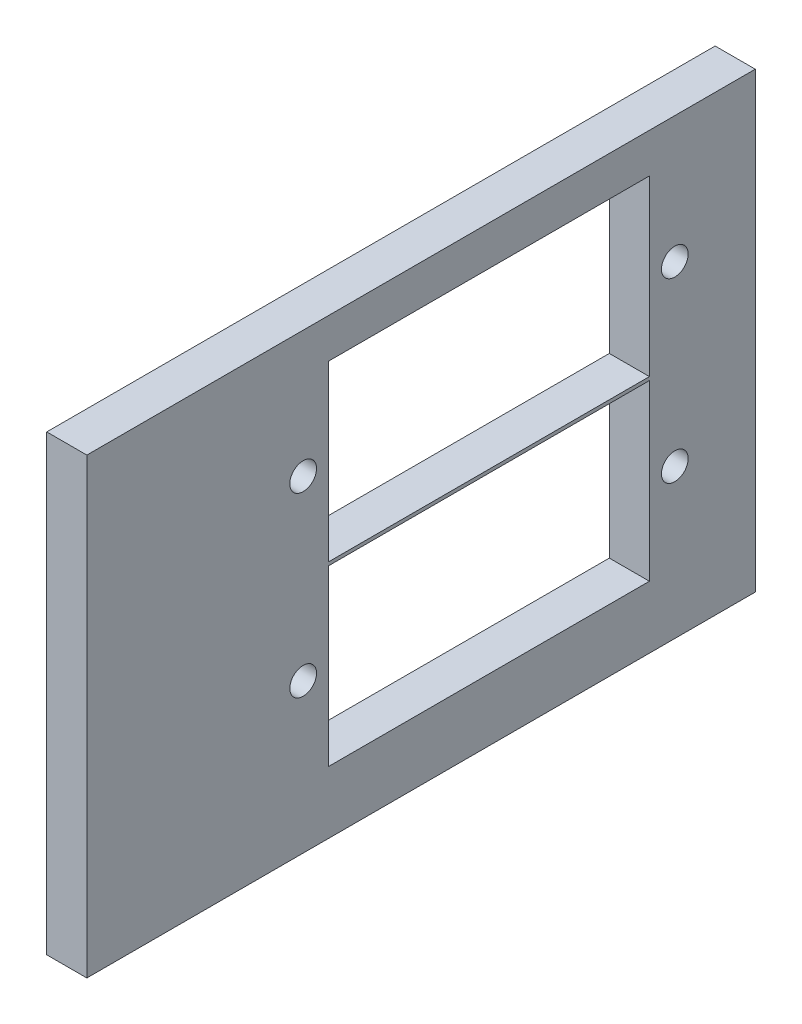
ISO-10303-21;
HEADER;
FILE_DESCRIPTION(('STEP AP214'),'2;1');
FILE_NAME('part.step','',(''),(''),'','','');
FILE_SCHEMA(('AUTOMOTIVE_DESIGN { 1 0 10303 214 1 1 1 1 }'));
ENDSEC;
DATA;
#1=APPLICATION_CONTEXT('core data for automotive mechanical design processes');
#2=APPLICATION_PROTOCOL_DEFINITION('international standard','automotive_design',2000,#1);
#3=PRODUCT_CONTEXT('',#1,'mechanical');
#4=PRODUCT('Part','Part','',(#3));
#5=PRODUCT_RELATED_PRODUCT_CATEGORY('part','',(#4));
#6=PRODUCT_DEFINITION_FORMATION('','',#4);
#7=PRODUCT_DEFINITION_CONTEXT('part definition',#1,'design');
#8=PRODUCT_DEFINITION('design','',#6,#7);
#9=PRODUCT_DEFINITION_SHAPE('','',#8);
#10=(LENGTH_UNIT() NAMED_UNIT(*) SI_UNIT(.MILLI.,.METRE.));
#11=(NAMED_UNIT(*) PLANE_ANGLE_UNIT() SI_UNIT($,.RADIAN.));
#12=(NAMED_UNIT(*) SI_UNIT($,.STERADIAN.) SOLID_ANGLE_UNIT());
#13=UNCERTAINTY_MEASURE_WITH_UNIT(LENGTH_MEASURE(1.E-05),#10,'distance_accuracy_value','');
#14=(GEOMETRIC_REPRESENTATION_CONTEXT(3) GLOBAL_UNCERTAINTY_ASSIGNED_CONTEXT((#13)) GLOBAL_UNIT_ASSIGNED_CONTEXT((#10,
#11,#12)) REPRESENTATION_CONTEXT('',''));
#15=CARTESIAN_POINT('',(0.,0.,0.));
#16=DIRECTION('',(0.,0.,1.));
#17=DIRECTION('',(1.,0.,0.));
#18=AXIS2_PLACEMENT_3D('',#15,#16,#17);
#19=CARTESIAN_POINT('',(3.,-56.7136635749748,-41.0383830188961));
#20=DIRECTION('',(0.,0.,1.));
#21=DIRECTION('',(1.,0.,0.));
#22=AXIS2_PLACEMENT_3D('',#19,#20,#21);
#23=PLANE('',#22);
#24=DIRECTION('',(0.,1.,0.));
#25=VECTOR('',#24,1.);
#26=CARTESIAN_POINT('',(0.,-56.7136635749748,-41.0383830188961));
#27=LINE('',#26,#25);
#28=CARTESIAN_POINT('',(0.,-56.7136635749748,-41.0383830188961));
#29=VERTEX_POINT('',#28);
#30=CARTESIAN_POINT('',(0.,-22.8366987069379,-41.0383830188961));
#31=VERTEX_POINT('',#30);
#32=EDGE_CURVE('E213',#29,#31,#27,.T.);
#33=ORIENTED_EDGE('',*,*,#32,.T.);
#34=DIRECTION('',(-1.,0.,0.));
#35=VECTOR('',#34,1.);
#36=CARTESIAN_POINT('',(3.,-22.8366987069379,-41.0383830188961));
#37=LINE('',#36,#35);
#38=CARTESIAN_POINT('',(3.,-22.8366987069379,-41.0383830188961));
#39=VERTEX_POINT('',#38);
#40=EDGE_CURVE('E11',#39,#31,#37,.T.);
#41=ORIENTED_EDGE('',*,*,#40,.F.);
#42=DIRECTION('',(0.,1.,0.));
#43=VECTOR('',#42,1.);
#44=CARTESIAN_POINT('',(3.,-56.7136635749748,-41.0383830188961));
#45=LINE('',#44,#43);
#46=CARTESIAN_POINT('',(3.,-56.7136635749748,-41.0383830188961));
#47=VERTEX_POINT('',#46);
#48=EDGE_CURVE('E216',#47,#39,#45,.T.);
#49=ORIENTED_EDGE('',*,*,#48,.F.);
#50=DIRECTION('',(-1.,0.,0.));
#51=VECTOR('',#50,1.);
#52=CARTESIAN_POINT('',(3.,-56.7136635749748,-41.0383830188961));
#53=LINE('',#52,#51);
#54=EDGE_CURVE('E226',#47,#29,#53,.T.);
#55=ORIENTED_EDGE('',*,*,#54,.T.);
#56=EDGE_LOOP('',(#33,#41,#49,#55));
#57=FACE_BOUND('',#56,.T.);
#58=ADVANCED_FACE('F33',(#57),#23,.F.);
#59=CARTESIAN_POINT('',(3.,-22.8366987069379,8.96161698110386));
#60=DIRECTION('',(0.,-1.,0.));
#61=DIRECTION('',(0.,0.,-1.));
#62=AXIS2_PLACEMENT_3D('',#59,#60,#61);
#63=PLANE('',#62);
#64=DIRECTION('',(0.,0.,1.));
#65=VECTOR('',#64,1.);
#66=CARTESIAN_POINT('',(0.,-22.8366987069379,8.96161698110386));
#67=LINE('',#66,#65);
#68=CARTESIAN_POINT('',(0.,-22.8366987069379,8.96161698110386));
#69=VERTEX_POINT('',#68);
#70=EDGE_CURVE('E229',#31,#69,#67,.T.);
#71=ORIENTED_EDGE('',*,*,#70,.T.);
#72=DIRECTION('',(-1.,0.,0.));
#73=VECTOR('',#72,1.);
#74=CARTESIAN_POINT('',(3.,-22.8366987069379,8.96161698110386));
#75=LINE('',#74,#73);
#76=CARTESIAN_POINT('',(3.,-22.8366987069379,8.96161698110386));
#77=VERTEX_POINT('',#76);
#78=EDGE_CURVE('E40',#77,#69,#75,.T.);
#79=ORIENTED_EDGE('',*,*,#78,.F.);
#80=DIRECTION('',(0.,0.,1.));
#81=VECTOR('',#80,1.);
#82=CARTESIAN_POINT('',(3.,-22.8366987069379,8.96161698110386));
#83=LINE('',#82,#81);
#84=EDGE_CURVE('E219',#39,#77,#83,.T.);
#85=ORIENTED_EDGE('',*,*,#84,.F.);
#86=ORIENTED_EDGE('',*,*,#40,.T.);
#87=EDGE_LOOP('',(#71,#79,#85,#86));
#88=FACE_BOUND('',#87,.T.);
#89=ADVANCED_FACE('F258',(#88),#63,.F.);
#90=CARTESIAN_POINT('',(3.,-56.7136635749748,8.96161698110386));
#91=DIRECTION('',(0.,0.,-1.));
#92=DIRECTION('',(-1.,0.,0.));
#93=AXIS2_PLACEMENT_3D('',#90,#91,#92);
#94=PLANE('',#93);
#95=DIRECTION('',(0.,-1.,0.));
#96=VECTOR('',#95,1.);
#97=CARTESIAN_POINT('',(0.,-56.7136635749748,8.96161698110386));
#98=LINE('',#97,#96);
#99=CARTESIAN_POINT('',(0.,-56.7136635749748,8.96161698110386));
#100=VERTEX_POINT('',#99);
#101=EDGE_CURVE('E231',#69,#100,#98,.T.);
#102=ORIENTED_EDGE('',*,*,#101,.T.);
#103=DIRECTION('',(-1.,0.,0.));
#104=VECTOR('',#103,1.);
#105=CARTESIAN_POINT('',(3.,-56.7136635749748,8.96161698110386));
#106=LINE('',#105,#104);
#107=CARTESIAN_POINT('',(3.,-56.7136635749748,8.96161698110386));
#108=VERTEX_POINT('',#107);
#109=EDGE_CURVE('E236',#108,#100,#106,.T.);
#110=ORIENTED_EDGE('',*,*,#109,.F.);
#111=DIRECTION('',(0.,-1.,0.));
#112=VECTOR('',#111,1.);
#113=CARTESIAN_POINT('',(3.,-56.7136635749748,8.96161698110386));
#114=LINE('',#113,#112);
#115=EDGE_CURVE('E222',#77,#108,#114,.T.);
#116=ORIENTED_EDGE('',*,*,#115,.F.);
#117=ORIENTED_EDGE('',*,*,#78,.T.);
#118=EDGE_LOOP('',(#102,#110,#116,#117));
#119=FACE_BOUND('',#118,.T.);
#120=ADVANCED_FACE('F243',(#119),#94,.F.);
#121=CARTESIAN_POINT('',(3.,-56.7136635749748,8.96161698110386));
#122=DIRECTION('',(0.,1.,0.));
#123=DIRECTION('',(0.,0.,1.));
#124=AXIS2_PLACEMENT_3D('',#121,#122,#123);
#125=PLANE('',#124);
#126=DIRECTION('',(0.,0.,-1.));
#127=VECTOR('',#126,1.);
#128=CARTESIAN_POINT('',(0.,-56.7136635749748,8.96161698110386));
#129=LINE('',#128,#127);
#130=EDGE_CURVE('E220',#100,#29,#129,.T.);
#131=ORIENTED_EDGE('',*,*,#130,.T.);
#132=ORIENTED_EDGE('',*,*,#54,.F.);
#133=DIRECTION('',(0.,0.,-1.));
#134=VECTOR('',#133,1.);
#135=CARTESIAN_POINT('',(3.,-56.7136635749748,8.96161698110386));
#136=LINE('',#135,#134);
#137=EDGE_CURVE('E224',#108,#47,#136,.T.);
#138=ORIENTED_EDGE('',*,*,#137,.F.);
#139=ORIENTED_EDGE('',*,*,#109,.T.);
#140=EDGE_LOOP('',(#131,#132,#138,#139));
#141=FACE_BOUND('',#140,.T.);
#142=ADVANCED_FACE('F252',(#141),#125,.F.);
#143=CARTESIAN_POINT('',(3.,0.,0.));
#144=DIRECTION('',(-1.,0.,0.));
#145=DIRECTION('',(0.,0.,1.));
#146=AXIS2_PLACEMENT_3D('',#143,#144,#145);
#147=PLANE('',#146);
#148=CARTESIAN_POINT('',(3.,-45.5516774752693,-7.22035364693341));
#149=DIRECTION('',(-1.,0.,0.));
#150=DIRECTION('',(0.,0.,1.));
#151=AXIS2_PLACEMENT_3D('',#148,#149,#150);
#152=CIRCLE('',#151,0.999999999999998);
#153=CARTESIAN_POINT('',(3.,-45.5516774752693,-6.22035364693341));
#154=VERTEX_POINT('',#153);
#155=EDGE_CURVE('E162',#154,#154,#152,.T.);
#156=ORIENTED_EDGE('',*,*,#155,.T.);
#157=EDGE_LOOP('',(#156));
#158=FACE_BOUND('',#157,.T.);
#159=DIRECTION('',(0.,0.,-1.));
#160=VECTOR('',#159,1.);
#161=CARTESIAN_POINT('',(3.,-39.0516774752693,-33.1203536469334));
#162=LINE('',#161,#160);
#163=CARTESIAN_POINT('',(3.,-39.0516774752693,-9.12035364693344));
#164=VERTEX_POINT('',#163);
#165=CARTESIAN_POINT('',(3.,-39.0516774752693,-33.1203536469334));
#166=VERTEX_POINT('',#165);
#167=EDGE_CURVE('E178',#164,#166,#162,.T.);
#168=ORIENTED_EDGE('',*,*,#167,.T.);
#169=DIRECTION('',(0.,-1.,0.));
#170=VECTOR('',#169,1.);
#171=CARTESIAN_POINT('',(3.,-39.0516774752693,-33.1203536469334));
#172=LINE('',#171,#170);
#173=CARTESIAN_POINT('',(3.,-52.0516774752693,-33.1203536469334));
#174=VERTEX_POINT('',#173);
#175=EDGE_CURVE('E170',#166,#174,#172,.T.);
#176=ORIENTED_EDGE('',*,*,#175,.T.);
#177=DIRECTION('',(0.,0.,1.));
#178=VECTOR('',#177,1.);
#179=CARTESIAN_POINT('',(3.,-52.0516774752693,-33.1203536469334));
#180=LINE('',#179,#178);
#181=CARTESIAN_POINT('',(3.,-52.0516774752693,-9.12035364693337));
#182=VERTEX_POINT('',#181);
#183=EDGE_CURVE('E173',#174,#182,#180,.T.);
#184=ORIENTED_EDGE('',*,*,#183,.T.);
#185=DIRECTION('',(0.,1.,0.));
#186=VECTOR('',#185,1.);
#187=CARTESIAN_POINT('',(3.,-39.0516774752693,-9.12035364693344));
#188=LINE('',#187,#186);
#189=EDGE_CURVE('E47',#182,#164,#188,.T.);
#190=ORIENTED_EDGE('',*,*,#189,.T.);
#191=EDGE_LOOP('',(#168,#176,#184,#190));
#192=FACE_BOUND('',#191,.T.);
#193=CARTESIAN_POINT('',(3.,-32.2939715691358,-35.0203536469334));
#194=DIRECTION('',(-1.,0.,0.));
#195=DIRECTION('',(0.,0.,1.));
#196=AXIS2_PLACEMENT_3D('',#193,#194,#195);
#197=CIRCLE('',#196,0.999999999999998);
#198=CARTESIAN_POINT('',(3.,-32.2939715691358,-34.0203536469334));
#199=VERTEX_POINT('',#198);
#200=EDGE_CURVE('E185',#199,#199,#197,.T.);
#201=ORIENTED_EDGE('',*,*,#200,.T.);
#202=EDGE_LOOP('',(#201));
#203=FACE_BOUND('',#202,.T.);
#204=CARTESIAN_POINT('',(3.,-32.2939715691358,-7.22035364693341));
#205=DIRECTION('',(-1.,0.,0.));
#206=DIRECTION('',(0.,0.,1.));
#207=AXIS2_PLACEMENT_3D('',#204,#205,#206);
#208=CIRCLE('',#207,0.999999999999998);
#209=CARTESIAN_POINT('',(3.,-32.2939715691358,-6.22035364693341));
#210=VERTEX_POINT('',#209);
#211=EDGE_CURVE('E205',#210,#210,#208,.T.);
#212=ORIENTED_EDGE('',*,*,#211,.T.);
#213=EDGE_LOOP('',(#212));
#214=FACE_BOUND('',#213,.T.);
#215=DIRECTION('',(0.,0.,-1.));
#216=VECTOR('',#215,1.);
#217=CARTESIAN_POINT('',(3.,-25.7939715691358,-33.1203536469334));
#218=LINE('',#217,#216);
#219=CARTESIAN_POINT('',(3.,-25.7939715691358,-9.12035364693341));
#220=VERTEX_POINT('',#219);
#221=CARTESIAN_POINT('',(3.,-25.7939715691358,-33.1203536469334));
#222=VERTEX_POINT('',#221);
#223=EDGE_CURVE('E133',#220,#222,#218,.T.);
#224=ORIENTED_EDGE('',*,*,#223,.T.);
#225=DIRECTION('',(0.,-1.,0.));
#226=VECTOR('',#225,1.);
#227=CARTESIAN_POINT('',(3.,-25.7939715691358,-33.1203536469334));
#228=LINE('',#227,#226);
#229=CARTESIAN_POINT('',(3.,-38.7939715691358,-33.1203536469334));
#230=VERTEX_POINT('',#229);
#231=EDGE_CURVE('E125',#222,#230,#228,.T.);
#232=ORIENTED_EDGE('',*,*,#231,.T.);
#233=DIRECTION('',(0.,0.,1.));
#234=VECTOR('',#233,1.);
#235=CARTESIAN_POINT('',(3.,-38.7939715691358,-33.1203536469334));
#236=LINE('',#235,#234);
#237=CARTESIAN_POINT('',(3.,-38.7939715691358,-9.12035364693341));
#238=VERTEX_POINT('',#237);
#239=EDGE_CURVE('E136',#230,#238,#236,.T.);
#240=ORIENTED_EDGE('',*,*,#239,.T.);
#241=DIRECTION('',(0.,1.,0.));
#242=VECTOR('',#241,1.);
#243=CARTESIAN_POINT('',(3.,-25.7939715691358,-9.12035364693341));
#244=LINE('',#243,#242);
#245=EDGE_CURVE('E55',#238,#220,#244,.T.);
#246=ORIENTED_EDGE('',*,*,#245,.T.);
#247=EDGE_LOOP('',(#224,#232,#240,#246));
#248=FACE_BOUND('',#247,.T.);
#249=CARTESIAN_POINT('',(3.,-45.5516774752693,-35.0203536469334));
#250=DIRECTION('',(-1.,0.,0.));
#251=DIRECTION('',(0.,0.,1.));
#252=AXIS2_PLACEMENT_3D('',#249,#250,#251);
#253=CIRCLE('',#252,0.999999999999998);
#254=CARTESIAN_POINT('',(3.,-45.5516774752693,-34.0203536469334));
#255=VERTEX_POINT('',#254);
#256=EDGE_CURVE('E210',#255,#255,#253,.T.);
#257=ORIENTED_EDGE('',*,*,#256,.T.);
#258=EDGE_LOOP('',(#257));
#259=FACE_BOUND('',#258,.T.);
#260=ORIENTED_EDGE('',*,*,#48,.T.);
#261=ORIENTED_EDGE('',*,*,#84,.T.);
#262=ORIENTED_EDGE('',*,*,#115,.T.);
#263=ORIENTED_EDGE('',*,*,#137,.T.);
#264=EDGE_LOOP('',(#260,#261,#262,#263));
#265=FACE_BOUND('',#264,.T.);
#266=ADVANCED_FACE('F140',(#158,#192,#203,#214,#248,#259,#265),#147,.F.);
#267=CARTESIAN_POINT('',(0.,0.,0.));
#268=DIRECTION('',(-1.,0.,0.));
#269=DIRECTION('',(0.,0.,1.));
#270=AXIS2_PLACEMENT_3D('',#267,#268,#269);
#271=PLANE('',#270);
#272=CARTESIAN_POINT('',(0.,-45.5516774752693,-7.22035364693341));
#273=DIRECTION('',(-1.,0.,0.));
#274=DIRECTION('',(0.,0.,1.));
#275=AXIS2_PLACEMENT_3D('',#272,#273,#274);
#276=CIRCLE('',#275,0.999999999999998);
#277=CARTESIAN_POINT('',(0.,-45.5516774752693,-6.22035364693341));
#278=VERTEX_POINT('',#277);
#279=EDGE_CURVE('E166',#278,#278,#276,.T.);
#280=ORIENTED_EDGE('',*,*,#279,.F.);
#281=EDGE_LOOP('',(#280));
#282=FACE_BOUND('',#281,.T.);
#283=DIRECTION('',(0.,-1.,0.));
#284=VECTOR('',#283,1.);
#285=CARTESIAN_POINT('',(0.,-39.0516774752693,-33.1203536469334));
#286=LINE('',#285,#284);
#287=CARTESIAN_POINT('',(0.,-39.0516774752693,-33.1203536469334));
#288=VERTEX_POINT('',#287);
#289=CARTESIAN_POINT('',(0.,-52.0516774752693,-33.1203536469334));
#290=VERTEX_POINT('',#289);
#291=EDGE_CURVE('E182',#288,#290,#286,.T.);
#292=ORIENTED_EDGE('',*,*,#291,.F.);
#293=DIRECTION('',(0.,0.,-1.));
#294=VECTOR('',#293,1.);
#295=CARTESIAN_POINT('',(0.,-39.0516774752693,-33.1203536469334));
#296=LINE('',#295,#294);
#297=CARTESIAN_POINT('',(0.,-39.0516774752693,-9.12035364693344));
#298=VERTEX_POINT('',#297);
#299=EDGE_CURVE('E174',#298,#288,#296,.T.);
#300=ORIENTED_EDGE('',*,*,#299,.F.);
#301=DIRECTION('',(0.,1.,0.));
#302=VECTOR('',#301,1.);
#303=CARTESIAN_POINT('',(0.,-39.0516774752693,-9.12035364693344));
#304=LINE('',#303,#302);
#305=CARTESIAN_POINT('',(0.,-52.0516774752693,-9.12035364693337));
#306=VERTEX_POINT('',#305);
#307=EDGE_CURVE('E188',#306,#298,#304,.T.);
#308=ORIENTED_EDGE('',*,*,#307,.F.);
#309=DIRECTION('',(0.,0.,1.));
#310=VECTOR('',#309,1.);
#311=CARTESIAN_POINT('',(0.,-52.0516774752693,-33.1203536469334));
#312=LINE('',#311,#310);
#313=EDGE_CURVE('E184',#290,#306,#312,.T.);
#314=ORIENTED_EDGE('',*,*,#313,.F.);
#315=EDGE_LOOP('',(#292,#300,#308,#314));
#316=FACE_BOUND('',#315,.T.);
#317=CARTESIAN_POINT('',(0.,-32.2939715691358,-35.0203536469334));
#318=DIRECTION('',(-1.,0.,0.));
#319=DIRECTION('',(0.,0.,1.));
#320=AXIS2_PLACEMENT_3D('',#317,#318,#319);
#321=CIRCLE('',#320,0.999999999999998);
#322=CARTESIAN_POINT('',(0.,-32.2939715691358,-34.0203536469334));
#323=VERTEX_POINT('',#322);
#324=EDGE_CURVE('E202',#323,#323,#321,.T.);
#325=ORIENTED_EDGE('',*,*,#324,.F.);
#326=EDGE_LOOP('',(#325));
#327=FACE_BOUND('',#326,.T.);
#328=CARTESIAN_POINT('',(0.,-32.2939715691358,-7.22035364693341));
#329=DIRECTION('',(-1.,0.,0.));
#330=DIRECTION('',(0.,0.,1.));
#331=AXIS2_PLACEMENT_3D('',#328,#329,#330);
#332=CIRCLE('',#331,0.999999999999998);
#333=CARTESIAN_POINT('',(0.,-32.2939715691358,-6.22035364693341));
#334=VERTEX_POINT('',#333);
#335=EDGE_CURVE('E158',#334,#334,#332,.T.);
#336=ORIENTED_EDGE('',*,*,#335,.F.);
#337=EDGE_LOOP('',(#336));
#338=FACE_BOUND('',#337,.T.);
#339=DIRECTION('',(0.,-1.,0.));
#340=VECTOR('',#339,1.);
#341=CARTESIAN_POINT('',(0.,-25.7939715691358,-33.1203536469334));
#342=LINE('',#341,#340);
#343=CARTESIAN_POINT('',(0.,-25.7939715691358,-33.1203536469334));
#344=VERTEX_POINT('',#343);
#345=CARTESIAN_POINT('',(0.,-38.7939715691358,-33.1203536469334));
#346=VERTEX_POINT('',#345);
#347=EDGE_CURVE('E128',#344,#346,#342,.T.);
#348=ORIENTED_EDGE('',*,*,#347,.F.);
#349=DIRECTION('',(0.,0.,-1.));
#350=VECTOR('',#349,1.);
#351=CARTESIAN_POINT('',(0.,-25.7939715691358,-33.1203536469334));
#352=LINE('',#351,#350);
#353=CARTESIAN_POINT('',(0.,-25.7939715691358,-9.12035364693341));
#354=VERTEX_POINT('',#353);
#355=EDGE_CURVE('E143',#354,#344,#352,.T.);
#356=ORIENTED_EDGE('',*,*,#355,.F.);
#357=DIRECTION('',(0.,1.,0.));
#358=VECTOR('',#357,1.);
#359=CARTESIAN_POINT('',(0.,-25.7939715691358,-9.12035364693341));
#360=LINE('',#359,#358);
#361=CARTESIAN_POINT('',(0.,-38.7939715691358,-9.12035364693341));
#362=VERTEX_POINT('',#361);
#363=EDGE_CURVE('E146',#362,#354,#360,.T.);
#364=ORIENTED_EDGE('',*,*,#363,.F.);
#365=DIRECTION('',(0.,0.,1.));
#366=VECTOR('',#365,1.);
#367=CARTESIAN_POINT('',(0.,-38.7939715691358,-33.1203536469334));
#368=LINE('',#367,#366);
#369=EDGE_CURVE('E152',#346,#362,#368,.T.);
#370=ORIENTED_EDGE('',*,*,#369,.F.);
#371=EDGE_LOOP('',(#348,#356,#364,#370));
#372=FACE_BOUND('',#371,.T.);
#373=CARTESIAN_POINT('',(0.,-45.5516774752693,-35.0203536469334));
#374=DIRECTION('',(-1.,0.,0.));
#375=DIRECTION('',(0.,0.,1.));
#376=AXIS2_PLACEMENT_3D('',#373,#374,#375);
#377=CIRCLE('',#376,0.999999999999998);
#378=CARTESIAN_POINT('',(0.,-45.5516774752693,-34.0203536469334));
#379=VERTEX_POINT('',#378);
#380=EDGE_CURVE('E165',#379,#379,#377,.T.);
#381=ORIENTED_EDGE('',*,*,#380,.F.);
#382=EDGE_LOOP('',(#381));
#383=FACE_BOUND('',#382,.T.);
#384=ORIENTED_EDGE('',*,*,#32,.F.);
#385=ORIENTED_EDGE('',*,*,#130,.F.);
#386=ORIENTED_EDGE('',*,*,#101,.F.);
#387=ORIENTED_EDGE('',*,*,#70,.F.);
#388=EDGE_LOOP('',(#384,#385,#386,#387));
#389=FACE_BOUND('',#388,.T.);
#390=ADVANCED_FACE('F249',(#282,#316,#327,#338,#372,#383,#389),#271,.T.);
#391=CARTESIAN_POINT('',(3.,-45.5516774752693,-35.0203536469334));
#392=DIRECTION('',(-1.,0.,0.));
#393=DIRECTION('',(0.,0.,1.));
#394=AXIS2_PLACEMENT_3D('',#391,#392,#393);
#395=CYLINDRICAL_SURFACE('',#394,0.999999999999998);
#396=ORIENTED_EDGE('',*,*,#256,.F.);
#397=EDGE_LOOP('',(#396));
#398=FACE_BOUND('',#397,.T.);
#399=ORIENTED_EDGE('',*,*,#380,.T.);
#400=EDGE_LOOP('',(#399));
#401=FACE_BOUND('',#400,.T.);
#402=ADVANCED_FACE('F270',(#398,#401),#395,.F.);
#403=CARTESIAN_POINT('',(3.,-25.7939715691358,-33.1203536469334));
#404=DIRECTION('',(0.,0.,-1.));
#405=DIRECTION('',(0.,1.,0.));
#406=AXIS2_PLACEMENT_3D('',#403,#404,#405);
#407=PLANE('',#406);
#408=ORIENTED_EDGE('',*,*,#347,.T.);
#409=DIRECTION('',(-1.,0.,0.));
#410=VECTOR('',#409,1.);
#411=CARTESIAN_POINT('',(3.,-38.7939715691358,-33.1203536469334));
#412=LINE('',#411,#410);
#413=EDGE_CURVE('E121',#230,#346,#412,.T.);
#414=ORIENTED_EDGE('',*,*,#413,.F.);
#415=ORIENTED_EDGE('',*,*,#231,.F.);
#416=DIRECTION('',(-1.,0.,0.));
#417=VECTOR('',#416,1.);
#418=CARTESIAN_POINT('',(3.,-25.7939715691358,-33.1203536469334));
#419=LINE('',#418,#417);
#420=EDGE_CURVE('E156',#222,#344,#419,.T.);
#421=ORIENTED_EDGE('',*,*,#420,.T.);
#422=EDGE_LOOP('',(#408,#414,#415,#421));
#423=FACE_BOUND('',#422,.T.);
#424=ADVANCED_FACE('F123',(#423),#407,.F.);
#425=CARTESIAN_POINT('',(3.,-25.7939715691358,-33.1203536469334));
#426=DIRECTION('',(0.,1.,0.));
#427=DIRECTION('',(0.,0.,1.));
#428=AXIS2_PLACEMENT_3D('',#425,#426,#427);
#429=PLANE('',#428);
#430=ORIENTED_EDGE('',*,*,#355,.T.);
#431=ORIENTED_EDGE('',*,*,#420,.F.);
#432=ORIENTED_EDGE('',*,*,#223,.F.);
#433=DIRECTION('',(-1.,0.,0.));
#434=VECTOR('',#433,1.);
#435=CARTESIAN_POINT('',(3.,-25.7939715691358,-9.12035364693341));
#436=LINE('',#435,#434);
#437=EDGE_CURVE('E159',#220,#354,#436,.T.);
#438=ORIENTED_EDGE('',*,*,#437,.T.);
#439=EDGE_LOOP('',(#430,#431,#432,#438));
#440=FACE_BOUND('',#439,.T.);
#441=ADVANCED_FACE('F307',(#440),#429,.F.);
#442=CARTESIAN_POINT('',(3.,-25.7939715691358,-9.12035364693341));
#443=DIRECTION('',(0.,0.,1.));
#444=DIRECTION('',(0.,-1.,0.));
#445=AXIS2_PLACEMENT_3D('',#442,#443,#444);
#446=PLANE('',#445);
#447=ORIENTED_EDGE('',*,*,#363,.T.);
#448=ORIENTED_EDGE('',*,*,#437,.F.);
#449=ORIENTED_EDGE('',*,*,#245,.F.);
#450=DIRECTION('',(-1.,0.,0.));
#451=VECTOR('',#450,1.);
#452=CARTESIAN_POINT('',(3.,-38.7939715691358,-9.12035364693341));
#453=LINE('',#452,#451);
#454=EDGE_CURVE('E132',#238,#362,#453,.T.);
#455=ORIENTED_EDGE('',*,*,#454,.T.);
#456=EDGE_LOOP('',(#447,#448,#449,#455));
#457=FACE_BOUND('',#456,.T.);
#458=ADVANCED_FACE('F310',(#457),#446,.F.);
#459=CARTESIAN_POINT('',(3.,-38.7939715691358,-33.1203536469334));
#460=DIRECTION('',(0.,-1.,0.));
#461=DIRECTION('',(0.,0.,-1.));
#462=AXIS2_PLACEMENT_3D('',#459,#460,#461);
#463=PLANE('',#462);
#464=ORIENTED_EDGE('',*,*,#369,.T.);
#465=ORIENTED_EDGE('',*,*,#454,.F.);
#466=ORIENTED_EDGE('',*,*,#239,.F.);
#467=ORIENTED_EDGE('',*,*,#413,.T.);
#468=EDGE_LOOP('',(#464,#465,#466,#467));
#469=FACE_BOUND('',#468,.T.);
#470=ADVANCED_FACE('F137',(#469),#463,.F.);
#471=CARTESIAN_POINT('',(3.,-32.2939715691358,-7.22035364693341));
#472=DIRECTION('',(-1.,0.,0.));
#473=DIRECTION('',(0.,0.,1.));
#474=AXIS2_PLACEMENT_3D('',#471,#472,#473);
#475=CYLINDRICAL_SURFACE('',#474,0.999999999999998);
#476=ORIENTED_EDGE('',*,*,#211,.F.);
#477=EDGE_LOOP('',(#476));
#478=FACE_BOUND('',#477,.T.);
#479=ORIENTED_EDGE('',*,*,#335,.T.);
#480=EDGE_LOOP('',(#479));
#481=FACE_BOUND('',#480,.T.);
#482=ADVANCED_FACE('F278',(#478,#481),#475,.F.);
#483=CARTESIAN_POINT('',(3.,-32.2939715691358,-35.0203536469334));
#484=DIRECTION('',(-1.,0.,0.));
#485=DIRECTION('',(0.,0.,1.));
#486=AXIS2_PLACEMENT_3D('',#483,#484,#485);
#487=CYLINDRICAL_SURFACE('',#486,0.999999999999998);
#488=ORIENTED_EDGE('',*,*,#200,.F.);
#489=EDGE_LOOP('',(#488));
#490=FACE_BOUND('',#489,.T.);
#491=ORIENTED_EDGE('',*,*,#324,.T.);
#492=EDGE_LOOP('',(#491));
#493=FACE_BOUND('',#492,.T.);
#494=ADVANCED_FACE('F281',(#490,#493),#487,.F.);
#495=CARTESIAN_POINT('',(3.,-39.0516774752693,-33.1203536469334));
#496=DIRECTION('',(0.,0.,-1.));
#497=DIRECTION('',(-1.,0.,0.));
#498=AXIS2_PLACEMENT_3D('',#495,#496,#497);
#499=PLANE('',#498);
#500=ORIENTED_EDGE('',*,*,#291,.T.);
#501=DIRECTION('',(-1.,0.,0.));
#502=VECTOR('',#501,1.);
#503=CARTESIAN_POINT('',(3.,-52.0516774752693,-33.1203536469334));
#504=LINE('',#503,#502);
#505=EDGE_CURVE('E181',#174,#290,#504,.T.);
#506=ORIENTED_EDGE('',*,*,#505,.F.);
#507=ORIENTED_EDGE('',*,*,#175,.F.);
#508=DIRECTION('',(-1.,0.,0.));
#509=VECTOR('',#508,1.);
#510=CARTESIAN_POINT('',(3.,-39.0516774752693,-33.1203536469334));
#511=LINE('',#510,#509);
#512=EDGE_CURVE('E169',#166,#288,#511,.T.);
#513=ORIENTED_EDGE('',*,*,#512,.T.);
#514=EDGE_LOOP('',(#500,#506,#507,#513));
#515=FACE_BOUND('',#514,.T.);
#516=ADVANCED_FACE('F285',(#515),#499,.F.);
#517=CARTESIAN_POINT('',(3.,-39.0516774752693,-33.1203536469334));
#518=DIRECTION('',(0.,1.,0.));
#519=DIRECTION('',(0.,0.,1.));
#520=AXIS2_PLACEMENT_3D('',#517,#518,#519);
#521=PLANE('',#520);
#522=ORIENTED_EDGE('',*,*,#299,.T.);
#523=ORIENTED_EDGE('',*,*,#512,.F.);
#524=ORIENTED_EDGE('',*,*,#167,.F.);
#525=DIRECTION('',(-1.,0.,0.));
#526=VECTOR('',#525,1.);
#527=CARTESIAN_POINT('',(3.,-39.0516774752693,-9.12035364693344));
#528=LINE('',#527,#526);
#529=EDGE_CURVE('E194',#164,#298,#528,.T.);
#530=ORIENTED_EDGE('',*,*,#529,.T.);
#531=EDGE_LOOP('',(#522,#523,#524,#530));
#532=FACE_BOUND('',#531,.T.);
#533=ADVANCED_FACE('F289',(#532),#521,.F.);
#534=CARTESIAN_POINT('',(3.,-39.0516774752693,-9.12035364693344));
#535=DIRECTION('',(0.,0.,1.));
#536=DIRECTION('',(0.,-1.,0.));
#537=AXIS2_PLACEMENT_3D('',#534,#535,#536);
#538=PLANE('',#537);
#539=ORIENTED_EDGE('',*,*,#307,.T.);
#540=ORIENTED_EDGE('',*,*,#529,.F.);
#541=ORIENTED_EDGE('',*,*,#189,.F.);
#542=DIRECTION('',(-1.,0.,0.));
#543=VECTOR('',#542,1.);
#544=CARTESIAN_POINT('',(3.,-52.0516774752693,-9.12035364693337));
#545=LINE('',#544,#543);
#546=EDGE_CURVE('E196',#182,#306,#545,.T.);
#547=ORIENTED_EDGE('',*,*,#546,.T.);
#548=EDGE_LOOP('',(#539,#540,#541,#547));
#549=FACE_BOUND('',#548,.T.);
#550=ADVANCED_FACE('F295',(#549),#538,.F.);
#551=CARTESIAN_POINT('',(3.,-52.0516774752693,-33.1203536469334));
#552=DIRECTION('',(0.,-1.,0.));
#553=DIRECTION('',(0.,0.,-1.));
#554=AXIS2_PLACEMENT_3D('',#551,#552,#553);
#555=PLANE('',#554);
#556=ORIENTED_EDGE('',*,*,#313,.T.);
#557=ORIENTED_EDGE('',*,*,#546,.F.);
#558=ORIENTED_EDGE('',*,*,#183,.F.);
#559=ORIENTED_EDGE('',*,*,#505,.T.);
#560=EDGE_LOOP('',(#556,#557,#558,#559));
#561=FACE_BOUND('',#560,.T.);
#562=ADVANCED_FACE('F291',(#561),#555,.F.);
#563=CARTESIAN_POINT('',(3.,-45.5516774752693,-7.22035364693341));
#564=DIRECTION('',(-1.,0.,0.));
#565=DIRECTION('',(0.,0.,1.));
#566=AXIS2_PLACEMENT_3D('',#563,#564,#565);
#567=CYLINDRICAL_SURFACE('',#566,0.999999999999998);
#568=ORIENTED_EDGE('',*,*,#155,.F.);
#569=EDGE_LOOP('',(#568));
#570=FACE_BOUND('',#569,.T.);
#571=ORIENTED_EDGE('',*,*,#279,.T.);
#572=EDGE_LOOP('',(#571));
#573=FACE_BOUND('',#572,.T.);
#574=ADVANCED_FACE('F294',(#570,#573),#567,.F.);
#575=CLOSED_SHELL('',(#58,#89,#120,#142,#266,#390,#402,#424,#441,#458,#470,#482,#494,#516,#533,
#550,#562,#574));
#576=MANIFOLD_SOLID_BREP('B2',#575);
#577=ADVANCED_BREP_SHAPE_REPRESENTATION('',(#18,#576),#14);
#578=SHAPE_DEFINITION_REPRESENTATION(#9,#577);
ENDSEC;
END-ISO-10303-21;
